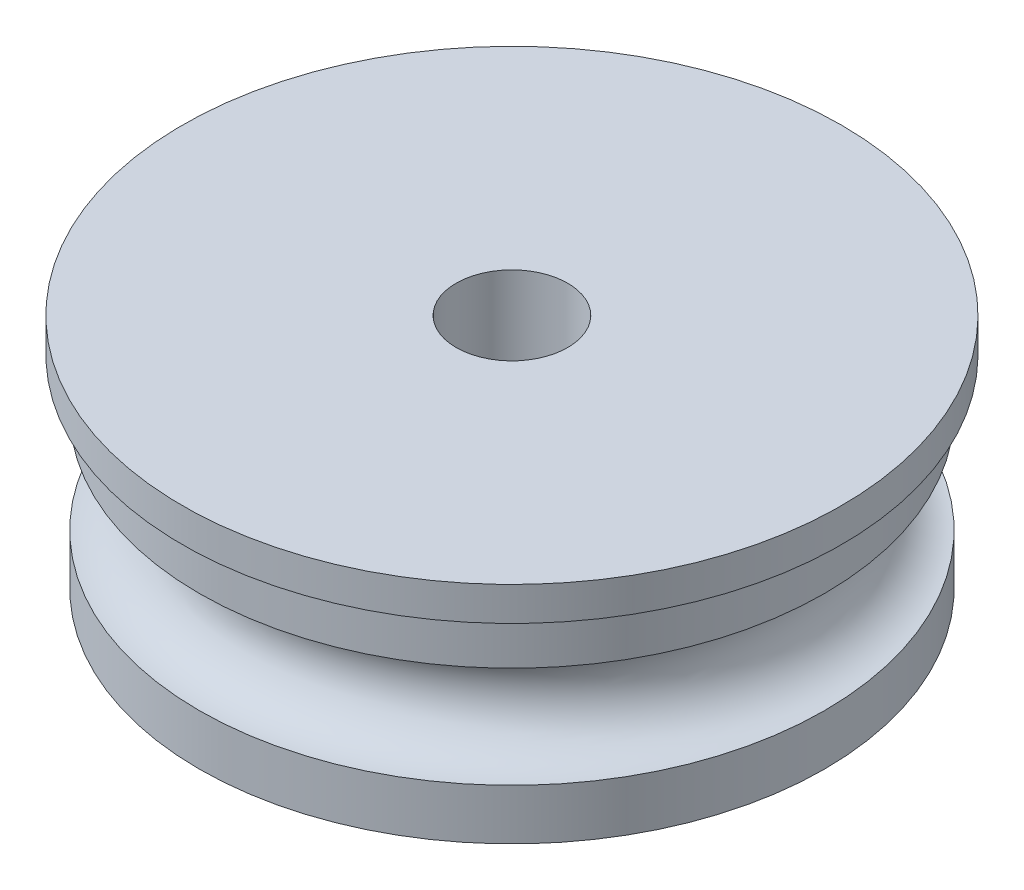
ISO-10303-21;
HEADER;
FILE_DESCRIPTION(('STEP AP214'),'2;1');
FILE_NAME('part.step','',(''),(''),'','','');
FILE_SCHEMA(('AUTOMOTIVE_DESIGN { 1 0 10303 214 1 1 1 1 }'));
ENDSEC;
DATA;
#1=APPLICATION_CONTEXT('core data for automotive mechanical design processes');
#2=APPLICATION_PROTOCOL_DEFINITION('international standard','automotive_design',2000,#1);
#3=PRODUCT_CONTEXT('',#1,'mechanical');
#4=PRODUCT('Part','Part','',(#3));
#5=PRODUCT_RELATED_PRODUCT_CATEGORY('part','',(#4));
#6=PRODUCT_DEFINITION_FORMATION('','',#4);
#7=PRODUCT_DEFINITION_CONTEXT('part definition',#1,'design');
#8=PRODUCT_DEFINITION('design','',#6,#7);
#9=PRODUCT_DEFINITION_SHAPE('','',#8);
#10=(LENGTH_UNIT() NAMED_UNIT(*) SI_UNIT(.MILLI.,.METRE.));
#11=(NAMED_UNIT(*) PLANE_ANGLE_UNIT() SI_UNIT($,.RADIAN.));
#12=(NAMED_UNIT(*) SI_UNIT($,.STERADIAN.) SOLID_ANGLE_UNIT());
#13=UNCERTAINTY_MEASURE_WITH_UNIT(LENGTH_MEASURE(1.E-05),#10,'distance_accuracy_value','');
#14=(GEOMETRIC_REPRESENTATION_CONTEXT(3) GLOBAL_UNCERTAINTY_ASSIGNED_CONTEXT((#13)) GLOBAL_UNIT_ASSIGNED_CONTEXT((#10,
#11,#12)) REPRESENTATION_CONTEXT('',''));
#15=CARTESIAN_POINT('',(0.,0.,0.));
#16=DIRECTION('',(0.,0.,1.));
#17=DIRECTION('',(1.,0.,0.));
#18=AXIS2_PLACEMENT_3D('',#15,#16,#17);
#19=CARTESIAN_POINT('',(0.,0.,0.));
#20=DIRECTION('',(0.,1.,0.));
#21=DIRECTION('',(0.,0.,1.));
#22=AXIS2_PLACEMENT_3D('',#19,#20,#21);
#23=PLANE('',#22);
#24=CARTESIAN_POINT('',(0.,0.,0.));
#25=DIRECTION('',(0.,-1.,0.));
#26=DIRECTION('',(0.,0.,-1.));
#27=AXIS2_PLACEMENT_3D('',#24,#25,#26);
#28=CIRCLE('',#27,6.);
#29=CARTESIAN_POINT('',(0.,0.,-6.));
#30=VERTEX_POINT('',#29);
#31=EDGE_CURVE('E78',#30,#30,#28,.T.);
#32=ORIENTED_EDGE('',*,*,#31,.F.);
#33=EDGE_LOOP('',(#32));
#34=FACE_BOUND('',#33,.T.);
#35=CARTESIAN_POINT('',(0.,0.,0.));
#36=DIRECTION('',(0.,-1.,0.));
#37=DIRECTION('',(0.,0.,-1.));
#38=AXIS2_PLACEMENT_3D('',#35,#36,#37);
#39=CIRCLE('',#38,9.25);
#40=CARTESIAN_POINT('',(0.,0.,-9.25));
#41=VERTEX_POINT('',#40);
#42=EDGE_CURVE('E10',#41,#41,#39,.T.);
#43=ORIENTED_EDGE('',*,*,#42,.T.);
#44=EDGE_LOOP('',(#43));
#45=FACE_BOUND('',#44,.T.);
#46=ADVANCED_FACE('F46',(#34,#45),#23,.F.);
#47=CARTESIAN_POINT('',(0.,0.,0.));
#48=DIRECTION('',(0.,-1.,0.));
#49=DIRECTION('',(0.,0.,-1.));
#50=AXIS2_PLACEMENT_3D('',#47,#48,#49);
#51=CYLINDRICAL_SURFACE('',#50,9.25);
#52=ORIENTED_EDGE('',*,*,#42,.F.);
#53=EDGE_LOOP('',(#52));
#54=FACE_BOUND('',#53,.T.);
#55=CARTESIAN_POINT('',(0.,1.5,0.));
#56=DIRECTION('',(0.,-1.,0.));
#57=DIRECTION('',(0.,0.,-1.));
#58=AXIS2_PLACEMENT_3D('',#55,#56,#57);
#59=CIRCLE('',#58,9.25);
#60=CARTESIAN_POINT('',(0.,1.5,-9.25));
#61=VERTEX_POINT('',#60);
#62=EDGE_CURVE('E53',#61,#61,#59,.T.);
#63=ORIENTED_EDGE('',*,*,#62,.T.);
#64=EDGE_LOOP('',(#63));
#65=FACE_BOUND('',#64,.T.);
#66=ADVANCED_FACE('F116',(#54,#65),#51,.T.);
#67=CARTESIAN_POINT('',(0.,3.,0.));
#68=DIRECTION('',(0.,-1.,0.));
#69=DIRECTION('',(0.,0.,-1.));
#70=AXIS2_PLACEMENT_3D('',#67,#68,#69);
#71=TOROIDAL_SURFACE('',#70,9.25,1.5);
#72=ORIENTED_EDGE('',*,*,#62,.F.);
#73=EDGE_LOOP('',(#72));
#74=FACE_BOUND('',#73,.T.);
#75=CARTESIAN_POINT('',(0.,4.5,0.));
#76=DIRECTION('',(0.,-1.,0.));
#77=DIRECTION('',(0.,0.,-1.));
#78=AXIS2_PLACEMENT_3D('',#75,#76,#77);
#79=CIRCLE('',#78,9.25);
#80=CARTESIAN_POINT('',(0.,4.5,-9.25));
#81=VERTEX_POINT('',#80);
#82=EDGE_CURVE('E58',#81,#81,#79,.T.);
#83=ORIENTED_EDGE('',*,*,#82,.T.);
#84=EDGE_LOOP('',(#83));
#85=FACE_BOUND('',#84,.T.);
#86=ADVANCED_FACE('F121',(#74,#85),#71,.F.);
#87=CARTESIAN_POINT('',(0.,0.,0.));
#88=DIRECTION('',(0.,-1.,0.));
#89=DIRECTION('',(0.,0.,-1.));
#90=AXIS2_PLACEMENT_3D('',#87,#88,#89);
#91=CYLINDRICAL_SURFACE('',#90,9.25);
#92=ORIENTED_EDGE('',*,*,#82,.F.);
#93=EDGE_LOOP('',(#92));
#94=FACE_BOUND('',#93,.T.);
#95=CARTESIAN_POINT('',(0.,6.,0.));
#96=DIRECTION('',(0.,-1.,0.));
#97=DIRECTION('',(0.,0.,-1.));
#98=AXIS2_PLACEMENT_3D('',#95,#96,#97);
#99=CIRCLE('',#98,9.25);
#100=CARTESIAN_POINT('',(0.,6.,-9.25));
#101=VERTEX_POINT('',#100);
#102=EDGE_CURVE('E63',#101,#101,#99,.T.);
#103=ORIENTED_EDGE('',*,*,#102,.T.);
#104=EDGE_LOOP('',(#103));
#105=FACE_BOUND('',#104,.T.);
#106=ADVANCED_FACE('F111',(#94,#105),#91,.T.);
#107=CARTESIAN_POINT('',(-9.75,6.,0.));
#108=DIRECTION('',(0.,1.,0.));
#109=DIRECTION('',(0.,0.,1.));
#110=AXIS2_PLACEMENT_3D('',#107,#108,#109);
#111=PLANE('',#110);
#112=ORIENTED_EDGE('',*,*,#102,.F.);
#113=EDGE_LOOP('',(#112));
#114=FACE_BOUND('',#113,.T.);
#115=CARTESIAN_POINT('',(0.,6.,0.));
#116=DIRECTION('',(0.,-1.,0.));
#117=DIRECTION('',(0.,0.,-1.));
#118=AXIS2_PLACEMENT_3D('',#115,#116,#117);
#119=CIRCLE('',#118,9.75);
#120=CARTESIAN_POINT('',(0.,6.,-9.75));
#121=VERTEX_POINT('',#120);
#122=EDGE_CURVE('E69',#121,#121,#119,.T.);
#123=ORIENTED_EDGE('',*,*,#122,.T.);
#124=EDGE_LOOP('',(#123));
#125=FACE_BOUND('',#124,.T.);
#126=ADVANCED_FACE('F105',(#114,#125),#111,.F.);
#127=CARTESIAN_POINT('',(0.,0.,0.));
#128=DIRECTION('',(0.,-1.,0.));
#129=DIRECTION('',(0.,0.,-1.));
#130=AXIS2_PLACEMENT_3D('',#127,#128,#129);
#131=CYLINDRICAL_SURFACE('',#130,9.75);
#132=ORIENTED_EDGE('',*,*,#122,.F.);
#133=EDGE_LOOP('',(#132));
#134=FACE_BOUND('',#133,.T.);
#135=CARTESIAN_POINT('',(0.,7.,0.));
#136=DIRECTION('',(0.,-1.,0.));
#137=DIRECTION('',(0.,0.,-1.));
#138=AXIS2_PLACEMENT_3D('',#135,#136,#137);
#139=CIRCLE('',#138,9.75);
#140=CARTESIAN_POINT('',(0.,7.,-9.75));
#141=VERTEX_POINT('',#140);
#142=EDGE_CURVE('E73',#141,#141,#139,.T.);
#143=ORIENTED_EDGE('',*,*,#142,.T.);
#144=EDGE_LOOP('',(#143));
#145=FACE_BOUND('',#144,.T.);
#146=ADVANCED_FACE('F100',(#134,#145),#131,.T.);
#147=CARTESIAN_POINT('',(0.,7.,0.));
#148=DIRECTION('',(0.,-1.,0.));
#149=DIRECTION('',(0.,0.,-1.));
#150=AXIS2_PLACEMENT_3D('',#147,#148,#149);
#151=PLANE('',#150);
#152=CARTESIAN_POINT('',(0.,7.,0.));
#153=DIRECTION('',(0.,1.,0.));
#154=DIRECTION('',(0.,0.,1.));
#155=AXIS2_PLACEMENT_3D('',#152,#153,#154);
#156=CIRCLE('',#155,1.65);
#157=CARTESIAN_POINT('',(0.,7.,1.65));
#158=VERTEX_POINT('',#157);
#159=EDGE_CURVE('E89',#158,#158,#156,.T.);
#160=ORIENTED_EDGE('',*,*,#159,.F.);
#161=EDGE_LOOP('',(#160));
#162=FACE_BOUND('',#161,.T.);
#163=ORIENTED_EDGE('',*,*,#142,.F.);
#164=EDGE_LOOP('',(#163));
#165=FACE_BOUND('',#164,.T.);
#166=ADVANCED_FACE('F96',(#162,#165),#151,.F.);
#167=CARTESIAN_POINT('',(0.,3.,0.));
#168=DIRECTION('',(0.,-1.,0.));
#169=DIRECTION('',(0.,0.,-1.));
#170=AXIS2_PLACEMENT_3D('',#167,#168,#169);
#171=CYLINDRICAL_SURFACE('',#170,6.);
#172=CARTESIAN_POINT('',(0.,3.,0.));
#173=DIRECTION('',(0.,-1.,0.));
#174=DIRECTION('',(0.,0.,-1.));
#175=AXIS2_PLACEMENT_3D('',#172,#173,#174);
#176=CIRCLE('',#175,6.);
#177=CARTESIAN_POINT('',(0.,3.,-6.));
#178=VERTEX_POINT('',#177);
#179=EDGE_CURVE('E77',#178,#178,#176,.T.);
#180=ORIENTED_EDGE('',*,*,#179,.F.);
#181=EDGE_LOOP('',(#180));
#182=FACE_BOUND('',#181,.T.);
#183=ORIENTED_EDGE('',*,*,#31,.T.);
#184=EDGE_LOOP('',(#183));
#185=FACE_BOUND('',#184,.T.);
#186=ADVANCED_FACE('F99',(#182,#185),#171,.F.);
#187=CARTESIAN_POINT('',(0.,3.,0.));
#188=DIRECTION('',(0.,-1.,0.));
#189=DIRECTION('',(0.,0.,-1.));
#190=AXIS2_PLACEMENT_3D('',#187,#188,#189);
#191=PLANE('',#190);
#192=CARTESIAN_POINT('',(0.,3.,0.));
#193=DIRECTION('',(0.,1.,0.));
#194=DIRECTION('',(0.,0.,1.));
#195=AXIS2_PLACEMENT_3D('',#192,#193,#194);
#196=CIRCLE('',#195,1.65);
#197=CARTESIAN_POINT('',(0.,3.,1.65));
#198=VERTEX_POINT('',#197);
#199=EDGE_CURVE('E82',#198,#198,#196,.T.);
#200=ORIENTED_EDGE('',*,*,#199,.T.);
#201=EDGE_LOOP('',(#200));
#202=FACE_BOUND('',#201,.T.);
#203=ORIENTED_EDGE('',*,*,#179,.T.);
#204=EDGE_LOOP('',(#203));
#205=FACE_BOUND('',#204,.T.);
#206=ADVANCED_FACE('F126',(#202,#205),#191,.T.);
#207=CARTESIAN_POINT('',(0.,7.,0.));
#208=DIRECTION('',(0.,1.,0.));
#209=DIRECTION('',(0.,0.,1.));
#210=AXIS2_PLACEMENT_3D('',#207,#208,#209);
#211=CYLINDRICAL_SURFACE('',#210,1.65);
#212=ORIENTED_EDGE('',*,*,#199,.F.);
#213=EDGE_LOOP('',(#212));
#214=FACE_BOUND('',#213,.T.);
#215=ORIENTED_EDGE('',*,*,#159,.T.);
#216=EDGE_LOOP('',(#215));
#217=FACE_BOUND('',#216,.T.);
#218=ADVANCED_FACE('F94',(#214,#217),#211,.F.);
#219=CLOSED_SHELL('',(#46,#66,#86,#106,#126,#146,#166,#186,#206,#218));
#220=MANIFOLD_SOLID_BREP('B2',#219);
#221=ADVANCED_BREP_SHAPE_REPRESENTATION('',(#18,#220),#14);
#222=SHAPE_DEFINITION_REPRESENTATION(#9,#221);
ENDSEC;
END-ISO-10303-21;
